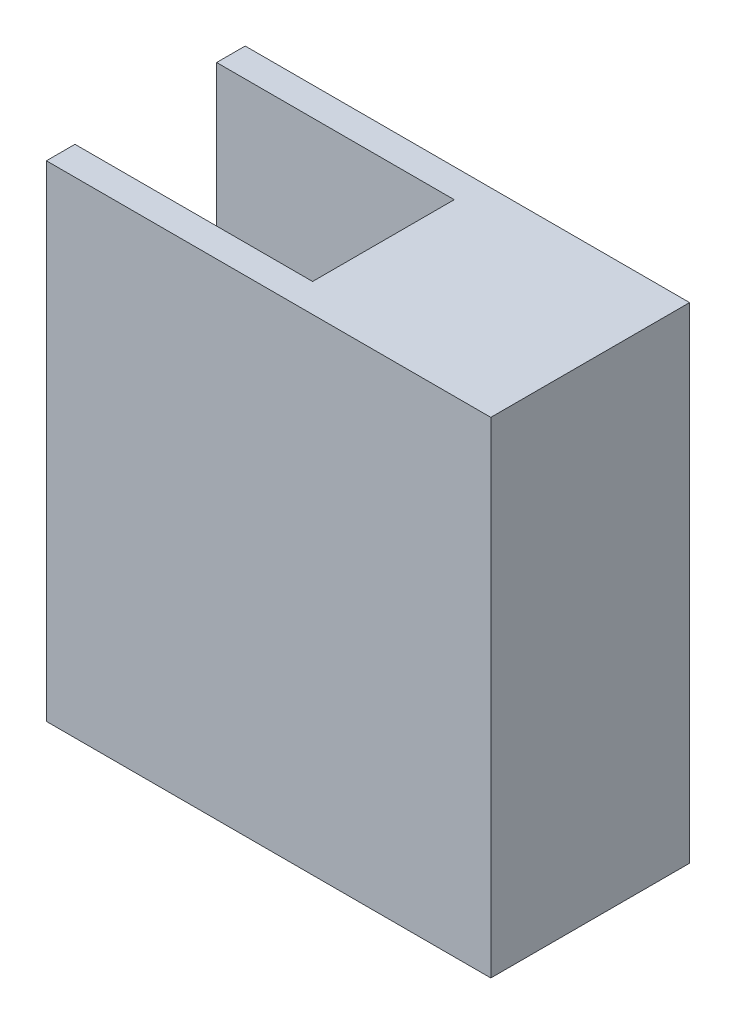
ISO-10303-21;
HEADER;
FILE_DESCRIPTION(('STEP AP214'),'2;1');
FILE_NAME('part.step','',(''),(''),'','','');
FILE_SCHEMA(('AUTOMOTIVE_DESIGN { 1 0 10303 214 1 1 1 1 }'));
ENDSEC;
DATA;
#1=APPLICATION_CONTEXT('core data for automotive mechanical design processes');
#2=APPLICATION_PROTOCOL_DEFINITION('international standard','automotive_design',2000,#1);
#3=PRODUCT_CONTEXT('',#1,'mechanical');
#4=PRODUCT('Part','Part','',(#3));
#5=PRODUCT_RELATED_PRODUCT_CATEGORY('part','',(#4));
#6=PRODUCT_DEFINITION_FORMATION('','',#4);
#7=PRODUCT_DEFINITION_CONTEXT('part definition',#1,'design');
#8=PRODUCT_DEFINITION('design','',#6,#7);
#9=PRODUCT_DEFINITION_SHAPE('','',#8);
#10=(LENGTH_UNIT() NAMED_UNIT(*) SI_UNIT(.MILLI.,.METRE.));
#11=(NAMED_UNIT(*) PLANE_ANGLE_UNIT() SI_UNIT($,.RADIAN.));
#12=(NAMED_UNIT(*) SI_UNIT($,.STERADIAN.) SOLID_ANGLE_UNIT());
#13=UNCERTAINTY_MEASURE_WITH_UNIT(LENGTH_MEASURE(1.E-05),#10,'distance_accuracy_value','');
#14=(GEOMETRIC_REPRESENTATION_CONTEXT(3) GLOBAL_UNCERTAINTY_ASSIGNED_CONTEXT((#13)) GLOBAL_UNIT_ASSIGNED_CONTEXT((#10,
#11,#12)) REPRESENTATION_CONTEXT('',''));
#15=CARTESIAN_POINT('',(0.,0.,0.));
#16=DIRECTION('',(0.,0.,1.));
#17=DIRECTION('',(1.,0.,0.));
#18=AXIS2_PLACEMENT_3D('',#15,#16,#17);
#19=CARTESIAN_POINT('',(-11.557,0.,0.));
#20=DIRECTION('',(1.,0.,0.));
#21=DIRECTION('',(0.,0.,-1.));
#22=AXIS2_PLACEMENT_3D('',#19,#20,#21);
#23=PLANE('',#22);
#24=DIRECTION('',(0.,0.,1.));
#25=VECTOR('',#24,1.);
#26=CARTESIAN_POINT('',(-11.557,13.49375,0.));
#27=LINE('',#26,#25);
#28=CARTESIAN_POINT('',(-11.557,13.49375,3.937));
#29=VERTEX_POINT('',#28);
#30=CARTESIAN_POINT('',(-11.557,13.49375,5.5245));
#31=VERTEX_POINT('',#30);
#32=EDGE_CURVE('E170',#29,#31,#27,.T.);
#33=ORIENTED_EDGE('',*,*,#32,.F.);
#34=DIRECTION('',(0.,1.,0.));
#35=VECTOR('',#34,1.);
#36=CARTESIAN_POINT('',(-11.557,0.,3.937));
#37=LINE('',#36,#35);
#38=CARTESIAN_POINT('',(-11.557,-13.49375,3.937));
#39=VERTEX_POINT('',#38);
#40=EDGE_CURVE('E177',#39,#29,#37,.T.);
#41=ORIENTED_EDGE('',*,*,#40,.F.);
#42=DIRECTION('',(0.,0.,1.));
#43=VECTOR('',#42,1.);
#44=CARTESIAN_POINT('',(-11.557,-13.49375,0.));
#45=LINE('',#44,#43);
#46=CARTESIAN_POINT('',(-11.557,-13.49375,5.5245));
#47=VERTEX_POINT('',#46);
#48=EDGE_CURVE('E167',#39,#47,#45,.T.);
#49=ORIENTED_EDGE('',*,*,#48,.T.);
#50=DIRECTION('',(0.,-1.,0.));
#51=VECTOR('',#50,1.);
#52=CARTESIAN_POINT('',(-11.557,0.,5.5245));
#53=LINE('',#52,#51);
#54=EDGE_CURVE('E174',#31,#47,#53,.T.);
#55=ORIENTED_EDGE('',*,*,#54,.F.);
#56=EDGE_LOOP('',(#33,#41,#49,#55));
#57=FACE_BOUND('',#56,.T.);
#58=ADVANCED_FACE('F33',(#57),#23,.F.);
#59=CARTESIAN_POINT('',(11.557,-11.58875,0.));
#60=DIRECTION('',(0.,-1.,0.));
#61=DIRECTION('',(0.,0.,-1.));
#62=AXIS2_PLACEMENT_3D('',#59,#60,#61);
#63=PLANE('',#62);
#64=DIRECTION('',(0.,0.,1.));
#65=VECTOR('',#64,1.);
#66=CARTESIAN_POINT('',(-11.557,-11.58875,0.));
#67=LINE('',#66,#65);
#68=CARTESIAN_POINT('',(-11.557,-11.58875,-0.508000000000003));
#69=VERTEX_POINT('',#68);
#70=CARTESIAN_POINT('',(-11.557,-11.58875,1.651));
#71=VERTEX_POINT('',#70);
#72=EDGE_CURVE('E156',#69,#71,#67,.T.);
#73=ORIENTED_EDGE('',*,*,#72,.T.);
#74=DIRECTION('',(-1.,0.,0.));
#75=VECTOR('',#74,1.);
#76=CARTESIAN_POINT('',(11.557,-11.58875,1.651));
#77=LINE('',#76,#75);
#78=CARTESIAN_POINT('',(11.557,-11.58875,1.651));
#79=VERTEX_POINT('',#78);
#80=EDGE_CURVE('E11',#79,#71,#77,.T.);
#81=ORIENTED_EDGE('',*,*,#80,.F.);
#82=DIRECTION('',(0.,0.,1.));
#83=VECTOR('',#82,1.);
#84=CARTESIAN_POINT('',(11.557,-11.58875,0.));
#85=LINE('',#84,#83);
#86=CARTESIAN_POINT('',(11.557,-11.58875,-0.508000000000003));
#87=VERTEX_POINT('',#86);
#88=EDGE_CURVE('E184',#87,#79,#85,.T.);
#89=ORIENTED_EDGE('',*,*,#88,.F.);
#90=DIRECTION('',(-1.,0.,0.));
#91=VECTOR('',#90,1.);
#92=CARTESIAN_POINT('',(11.557,-11.58875,-0.508000000000003));
#93=LINE('',#92,#91);
#94=EDGE_CURVE('E155',#87,#69,#93,.T.);
#95=ORIENTED_EDGE('',*,*,#94,.T.);
#96=EDGE_LOOP('',(#73,#81,#89,#95));
#97=FACE_BOUND('',#96,.T.);
#98=ADVANCED_FACE('F35',(#97),#63,.F.);
#99=CARTESIAN_POINT('',(11.557,0.,1.651));
#100=DIRECTION('',(0.,0.,-1.));
#101=DIRECTION('',(0.,1.,0.));
#102=AXIS2_PLACEMENT_3D('',#99,#100,#101);
#103=PLANE('',#102);
#104=DIRECTION('',(0.,-1.,0.));
#105=VECTOR('',#104,1.);
#106=CARTESIAN_POINT('',(-11.557,0.,1.651));
#107=LINE('',#106,#105);
#108=CARTESIAN_POINT('',(-11.557,-13.49375,1.651));
#109=VERTEX_POINT('',#108);
#110=EDGE_CURVE('E159',#71,#109,#107,.T.);
#111=ORIENTED_EDGE('',*,*,#110,.T.);
#112=DIRECTION('',(-1.,0.,0.));
#113=VECTOR('',#112,1.);
#114=CARTESIAN_POINT('',(11.557,-13.49375,1.651));
#115=LINE('',#114,#113);
#116=CARTESIAN_POINT('',(11.557,-13.49375,1.651));
#117=VERTEX_POINT('',#116);
#118=EDGE_CURVE('E41',#117,#109,#115,.T.);
#119=ORIENTED_EDGE('',*,*,#118,.F.);
#120=DIRECTION('',(0.,-1.,0.));
#121=VECTOR('',#120,1.);
#122=CARTESIAN_POINT('',(11.557,0.,1.651));
#123=LINE('',#122,#121);
#124=EDGE_CURVE('E103',#79,#117,#123,.T.);
#125=ORIENTED_EDGE('',*,*,#124,.F.);
#126=ORIENTED_EDGE('',*,*,#80,.T.);
#127=EDGE_LOOP('',(#111,#119,#125,#126));
#128=FACE_BOUND('',#127,.T.);
#129=ADVANCED_FACE('F206',(#128),#103,.F.);
#130=CARTESIAN_POINT('',(11.557,0.,-5.5245));
#131=DIRECTION('',(0.,0.,-1.));
#132=DIRECTION('',(0.,1.,0.));
#133=AXIS2_PLACEMENT_3D('',#130,#131,#132);
#134=PLANE('',#133);
#135=DIRECTION('',(0.,-1.,0.));
#136=VECTOR('',#135,1.);
#137=CARTESIAN_POINT('',(-11.557,0.,-5.5245));
#138=LINE('',#137,#136);
#139=CARTESIAN_POINT('',(-11.557,13.49375,-5.5245));
#140=VERTEX_POINT('',#139);
#141=CARTESIAN_POINT('',(-11.557,-13.49375,-5.5245));
#142=VERTEX_POINT('',#141);
#143=EDGE_CURVE('E166',#140,#142,#138,.T.);
#144=ORIENTED_EDGE('',*,*,#143,.F.);
#145=DIRECTION('',(-1.,0.,0.));
#146=VECTOR('',#145,1.);
#147=CARTESIAN_POINT('',(11.557,13.49375,-5.5245));
#148=LINE('',#147,#146);
#149=CARTESIAN_POINT('',(13.1445,13.49375,-5.5245));
#150=VERTEX_POINT('',#149);
#151=EDGE_CURVE('E196',#150,#140,#148,.T.);
#152=ORIENTED_EDGE('',*,*,#151,.F.);
#153=DIRECTION('',(0.,1.,0.));
#154=VECTOR('',#153,1.);
#155=CARTESIAN_POINT('',(13.1445,13.49375,-5.5245));
#156=LINE('',#155,#154);
#157=CARTESIAN_POINT('',(13.1445,-13.49375,-5.5245));
#158=VERTEX_POINT('',#157);
#159=EDGE_CURVE('E217',#158,#150,#156,.T.);
#160=ORIENTED_EDGE('',*,*,#159,.F.);
#161=DIRECTION('',(-1.,0.,0.));
#162=VECTOR('',#161,1.);
#163=CARTESIAN_POINT('',(11.557,-13.49375,-5.5245));
#164=LINE('',#163,#162);
#165=EDGE_CURVE('E198',#158,#142,#164,.T.);
#166=ORIENTED_EDGE('',*,*,#165,.T.);
#167=EDGE_LOOP('',(#144,#152,#160,#166));
#168=FACE_BOUND('',#167,.T.);
#169=ADVANCED_FACE('F212',(#168),#134,.T.);
#170=CARTESIAN_POINT('',(11.557,13.49375,0.));
#171=DIRECTION('',(0.,-1.,0.));
#172=DIRECTION('',(0.,0.,-1.));
#173=AXIS2_PLACEMENT_3D('',#170,#171,#172);
#174=PLANE('',#173);
#175=DIRECTION('',(0.,0.,-1.));
#176=VECTOR('',#175,1.);
#177=CARTESIAN_POINT('',(1.651,13.49375,3.937));
#178=LINE('',#177,#176);
#179=CARTESIAN_POINT('',(1.651,13.49375,3.937));
#180=VERTEX_POINT('',#179);
#181=CARTESIAN_POINT('',(1.651,13.49375,-3.937));
#182=VERTEX_POINT('',#181);
#183=EDGE_CURVE('E291',#180,#182,#178,.T.);
#184=ORIENTED_EDGE('',*,*,#183,.F.);
#185=DIRECTION('',(1.,0.,0.));
#186=VECTOR('',#185,1.);
#187=CARTESIAN_POINT('',(-11.557,13.49375,3.937));
#188=LINE('',#187,#186);
#189=EDGE_CURVE('E283',#29,#180,#188,.T.);
#190=ORIENTED_EDGE('',*,*,#189,.F.);
#191=ORIENTED_EDGE('',*,*,#32,.T.);
#192=DIRECTION('',(-1.,0.,0.));
#193=VECTOR('',#192,1.);
#194=CARTESIAN_POINT('',(11.557,13.49375,5.5245));
#195=LINE('',#194,#193);
#196=CARTESIAN_POINT('',(13.1445,13.49375,5.5245));
#197=VERTEX_POINT('',#196);
#198=EDGE_CURVE('E193',#197,#31,#195,.T.);
#199=ORIENTED_EDGE('',*,*,#198,.F.);
#200=DIRECTION('',(0.,0.,1.));
#201=VECTOR('',#200,1.);
#202=CARTESIAN_POINT('',(13.1445,13.49375,5.5245));
#203=LINE('',#202,#201);
#204=EDGE_CURVE('E160',#150,#197,#203,.T.);
#205=ORIENTED_EDGE('',*,*,#204,.F.);
#206=ORIENTED_EDGE('',*,*,#151,.T.);
#207=CARTESIAN_POINT('',(-11.557,13.49375,-3.937));
#208=VERTEX_POINT('',#207);
#209=EDGE_CURVE('E171',#140,#208,#27,.T.);
#210=ORIENTED_EDGE('',*,*,#209,.T.);
#211=DIRECTION('',(-1.,0.,0.));
#212=VECTOR('',#211,1.);
#213=CARTESIAN_POINT('',(-11.557,13.49375,-3.937));
#214=LINE('',#213,#212);
#215=EDGE_CURVE('E289',#182,#208,#214,.T.);
#216=ORIENTED_EDGE('',*,*,#215,.F.);
#217=EDGE_LOOP('',(#184,#190,#191,#199,#205,#206,#210,#216));
#218=FACE_BOUND('',#217,.T.);
#219=ADVANCED_FACE('F298',(#218),#174,.F.);
#220=CARTESIAN_POINT('',(11.557,0.,5.5245));
#221=DIRECTION('',(0.,0.,-1.));
#222=DIRECTION('',(0.,1.,0.));
#223=AXIS2_PLACEMENT_3D('',#220,#221,#222);
#224=PLANE('',#223);
#225=ORIENTED_EDGE('',*,*,#54,.T.);
#226=DIRECTION('',(-1.,0.,0.));
#227=VECTOR('',#226,1.);
#228=CARTESIAN_POINT('',(11.557,-13.49375,5.5245));
#229=LINE('',#228,#227);
#230=CARTESIAN_POINT('',(13.1445,-13.49375,5.5245));
#231=VERTEX_POINT('',#230);
#232=EDGE_CURVE('E191',#231,#47,#229,.T.);
#233=ORIENTED_EDGE('',*,*,#232,.F.);
#234=DIRECTION('',(0.,-1.,0.));
#235=VECTOR('',#234,1.);
#236=CARTESIAN_POINT('',(13.1445,13.49375,5.5245));
#237=LINE('',#236,#235);
#238=EDGE_CURVE('E229',#197,#231,#237,.T.);
#239=ORIENTED_EDGE('',*,*,#238,.F.);
#240=ORIENTED_EDGE('',*,*,#198,.T.);
#241=EDGE_LOOP('',(#225,#233,#239,#240));
#242=FACE_BOUND('',#241,.T.);
#243=ADVANCED_FACE('F303',(#242),#224,.F.);
#244=CARTESIAN_POINT('',(11.557,-13.49375,0.));
#245=DIRECTION('',(0.,-1.,0.));
#246=DIRECTION('',(0.,0.,-1.));
#247=AXIS2_PLACEMENT_3D('',#244,#245,#246);
#248=PLANE('',#247);
#249=ORIENTED_EDGE('',*,*,#48,.F.);
#250=DIRECTION('',(-1.,0.,0.));
#251=VECTOR('',#250,1.);
#252=CARTESIAN_POINT('',(11.557,-13.49375,3.937));
#253=LINE('',#252,#251);
#254=CARTESIAN_POINT('',(11.557,-13.49375,3.937));
#255=VERTEX_POINT('',#254);
#256=EDGE_CURVE('E189',#255,#39,#253,.T.);
#257=ORIENTED_EDGE('',*,*,#256,.F.);
#258=DIRECTION('',(0.,0.,-1.));
#259=VECTOR('',#258,1.);
#260=CARTESIAN_POINT('',(11.557,-13.49375,5.5245));
#261=LINE('',#260,#259);
#262=EDGE_CURVE('E205',#255,#117,#261,.T.);
#263=ORIENTED_EDGE('',*,*,#262,.T.);
#264=ORIENTED_EDGE('',*,*,#118,.T.);
#265=EDGE_CURVE('E163',#142,#109,#45,.T.);
#266=ORIENTED_EDGE('',*,*,#265,.F.);
#267=ORIENTED_EDGE('',*,*,#165,.F.);
#268=DIRECTION('',(0.,0.,-1.));
#269=VECTOR('',#268,1.);
#270=CARTESIAN_POINT('',(13.1445,-13.49375,5.5245));
#271=LINE('',#270,#269);
#272=EDGE_CURVE('E221',#231,#158,#271,.T.);
#273=ORIENTED_EDGE('',*,*,#272,.F.);
#274=ORIENTED_EDGE('',*,*,#232,.T.);
#275=EDGE_LOOP('',(#249,#257,#263,#264,#266,#267,#273,#274));
#276=FACE_BOUND('',#275,.T.);
#277=ADVANCED_FACE('F203',(#276),#248,.T.);
#278=CARTESIAN_POINT('',(11.557,0.,3.937));
#279=DIRECTION('',(0.,0.,1.));
#280=DIRECTION('',(1.,0.,0.));
#281=AXIS2_PLACEMENT_3D('',#278,#279,#280);
#282=PLANE('',#281);
#283=ORIENTED_EDGE('',*,*,#40,.T.);
#284=ORIENTED_EDGE('',*,*,#189,.T.);
#285=DIRECTION('',(0.,1.,0.));
#286=VECTOR('',#285,1.);
#287=CARTESIAN_POINT('',(1.651,-13.49475,3.93699999999999));
#288=LINE('',#287,#286);
#289=CARTESIAN_POINT('',(1.651,11.90625,3.937));
#290=VERTEX_POINT('',#289);
#291=EDGE_CURVE('E279',#290,#180,#288,.T.);
#292=ORIENTED_EDGE('',*,*,#291,.F.);
#293=DIRECTION('',(-1.,0.,0.));
#294=VECTOR('',#293,1.);
#295=CARTESIAN_POINT('',(11.557,11.90625,3.937));
#296=LINE('',#295,#294);
#297=CARTESIAN_POINT('',(11.557,11.90625,3.937));
#298=VERTEX_POINT('',#297);
#299=EDGE_CURVE('E131',#298,#290,#296,.T.);
#300=ORIENTED_EDGE('',*,*,#299,.F.);
#301=DIRECTION('',(0.,1.,0.));
#302=VECTOR('',#301,1.);
#303=CARTESIAN_POINT('',(11.557,0.,3.937));
#304=LINE('',#303,#302);
#305=EDGE_CURVE('E146',#255,#298,#304,.T.);
#306=ORIENTED_EDGE('',*,*,#305,.F.);
#307=ORIENTED_EDGE('',*,*,#256,.T.);
#308=EDGE_LOOP('',(#283,#284,#292,#300,#306,#307));
#309=FACE_BOUND('',#308,.T.);
#310=ADVANCED_FACE('F286',(#309),#282,.F.);
#311=CARTESIAN_POINT('',(11.557,11.90625,0.));
#312=DIRECTION('',(0.,1.,0.));
#313=DIRECTION('',(0.,0.,1.));
#314=AXIS2_PLACEMENT_3D('',#311,#312,#313);
#315=PLANE('',#314);
#316=ORIENTED_EDGE('',*,*,#299,.T.);
#317=DIRECTION('',(0.,0.,1.));
#318=VECTOR('',#317,1.);
#319=CARTESIAN_POINT('',(1.651,11.90625,3.93699999999999));
#320=LINE('',#319,#318);
#321=CARTESIAN_POINT('',(1.651,11.90625,-3.937));
#322=VERTEX_POINT('',#321);
#323=EDGE_CURVE('E128',#322,#290,#320,.T.);
#324=ORIENTED_EDGE('',*,*,#323,.F.);
#325=DIRECTION('',(-1.,0.,0.));
#326=VECTOR('',#325,1.);
#327=CARTESIAN_POINT('',(11.557,11.90625,-3.937));
#328=LINE('',#327,#326);
#329=CARTESIAN_POINT('',(11.557,11.90625,-3.937));
#330=VERTEX_POINT('',#329);
#331=EDGE_CURVE('E119',#330,#322,#328,.T.);
#332=ORIENTED_EDGE('',*,*,#331,.F.);
#333=DIRECTION('',(0.,0.,-1.));
#334=VECTOR('',#333,1.);
#335=CARTESIAN_POINT('',(11.557,11.90625,0.));
#336=LINE('',#335,#334);
#337=EDGE_CURVE('E124',#298,#330,#336,.T.);
#338=ORIENTED_EDGE('',*,*,#337,.F.);
#339=EDGE_LOOP('',(#316,#324,#332,#338));
#340=FACE_BOUND('',#339,.T.);
#341=ADVANCED_FACE('F122',(#340),#315,.F.);
#342=CARTESIAN_POINT('',(11.557,0.,-3.937));
#343=DIRECTION('',(0.,0.,-1.));
#344=DIRECTION('',(-1.,0.,0.));
#345=AXIS2_PLACEMENT_3D('',#342,#343,#344);
#346=PLANE('',#345);
#347=DIRECTION('',(0.,-1.,0.));
#348=VECTOR('',#347,1.);
#349=CARTESIAN_POINT('',(-11.557,0.,-3.937));
#350=LINE('',#349,#348);
#351=CARTESIAN_POINT('',(-11.557,3.65124999999999,-3.937));
#352=VERTEX_POINT('',#351);
#353=EDGE_CURVE('E48',#208,#352,#350,.T.);
#354=ORIENTED_EDGE('',*,*,#353,.T.);
#355=DIRECTION('',(-1.,0.,0.));
#356=VECTOR('',#355,1.);
#357=CARTESIAN_POINT('',(11.557,3.65124999999999,-3.937));
#358=LINE('',#357,#356);
#359=CARTESIAN_POINT('',(11.557,3.65124999999999,-3.937));
#360=VERTEX_POINT('',#359);
#361=EDGE_CURVE('E132',#360,#352,#358,.T.);
#362=ORIENTED_EDGE('',*,*,#361,.F.);
#363=DIRECTION('',(0.,-1.,0.));
#364=VECTOR('',#363,1.);
#365=CARTESIAN_POINT('',(11.557,0.,-3.937));
#366=LINE('',#365,#364);
#367=EDGE_CURVE('E135',#330,#360,#366,.T.);
#368=ORIENTED_EDGE('',*,*,#367,.F.);
#369=ORIENTED_EDGE('',*,*,#331,.T.);
#370=DIRECTION('',(0.,1.,0.));
#371=VECTOR('',#370,1.);
#372=CARTESIAN_POINT('',(1.651,-13.49475,-3.93700000000001));
#373=LINE('',#372,#371);
#374=EDGE_CURVE('E237',#322,#182,#373,.T.);
#375=ORIENTED_EDGE('',*,*,#374,.T.);
#376=ORIENTED_EDGE('',*,*,#215,.T.);
#377=EDGE_LOOP('',(#354,#362,#368,#369,#375,#376));
#378=FACE_BOUND('',#377,.T.);
#379=ADVANCED_FACE('F136',(#378),#346,.F.);
#380=CARTESIAN_POINT('',(11.557,3.65124999999999,0.));
#381=DIRECTION('',(0.,-1.,0.));
#382=DIRECTION('',(0.,0.,-1.));
#383=AXIS2_PLACEMENT_3D('',#380,#381,#382);
#384=PLANE('',#383);
#385=DIRECTION('',(0.,0.,1.));
#386=VECTOR('',#385,1.);
#387=CARTESIAN_POINT('',(-11.557,3.65124999999999,0.));
#388=LINE('',#387,#386);
#389=CARTESIAN_POINT('',(-11.557,3.65124999999999,-0.508000000000002));
#390=VERTEX_POINT('',#389);
#391=EDGE_CURVE('E181',#352,#390,#388,.T.);
#392=ORIENTED_EDGE('',*,*,#391,.T.);
#393=DIRECTION('',(-1.,0.,0.));
#394=VECTOR('',#393,1.);
#395=CARTESIAN_POINT('',(11.557,3.65124999999999,-0.508000000000002));
#396=LINE('',#395,#394);
#397=CARTESIAN_POINT('',(11.557,3.65124999999999,-0.508000000000002));
#398=VERTEX_POINT('',#397);
#399=EDGE_CURVE('E57',#398,#390,#396,.T.);
#400=ORIENTED_EDGE('',*,*,#399,.F.);
#401=DIRECTION('',(0.,0.,1.));
#402=VECTOR('',#401,1.);
#403=CARTESIAN_POINT('',(11.557,3.65124999999999,0.));
#404=LINE('',#403,#402);
#405=EDGE_CURVE('E140',#360,#398,#404,.T.);
#406=ORIENTED_EDGE('',*,*,#405,.F.);
#407=ORIENTED_EDGE('',*,*,#361,.T.);
#408=EDGE_LOOP('',(#392,#400,#406,#407));
#409=FACE_BOUND('',#408,.T.);
#410=ADVANCED_FACE('F242',(#409),#384,.F.);
#411=CARTESIAN_POINT('',(11.557,0.,-0.508000000000002));
#412=DIRECTION('',(0.,0.,-1.));
#413=DIRECTION('',(0.,1.,0.));
#414=AXIS2_PLACEMENT_3D('',#411,#412,#413);
#415=PLANE('',#414);
#416=DIRECTION('',(0.,-1.,0.));
#417=VECTOR('',#416,1.);
#418=CARTESIAN_POINT('',(-11.557,0.,-0.508000000000002));
#419=LINE('',#418,#417);
#420=EDGE_CURVE('E95',#390,#69,#419,.T.);
#421=ORIENTED_EDGE('',*,*,#420,.T.);
#422=ORIENTED_EDGE('',*,*,#94,.F.);
#423=DIRECTION('',(0.,-1.,0.));
#424=VECTOR('',#423,1.);
#425=CARTESIAN_POINT('',(11.557,0.,-0.508000000000002));
#426=LINE('',#425,#424);
#427=EDGE_CURVE('E152',#398,#87,#426,.T.);
#428=ORIENTED_EDGE('',*,*,#427,.F.);
#429=ORIENTED_EDGE('',*,*,#399,.T.);
#430=EDGE_LOOP('',(#421,#422,#428,#429));
#431=FACE_BOUND('',#430,.T.);
#432=ADVANCED_FACE('F241',(#431),#415,.F.);
#433=ORIENTED_EDGE('',*,*,#353,.F.);
#434=ORIENTED_EDGE('',*,*,#209,.F.);
#435=ORIENTED_EDGE('',*,*,#143,.T.);
#436=ORIENTED_EDGE('',*,*,#265,.T.);
#437=ORIENTED_EDGE('',*,*,#110,.F.);
#438=ORIENTED_EDGE('',*,*,#72,.F.);
#439=ORIENTED_EDGE('',*,*,#420,.F.);
#440=ORIENTED_EDGE('',*,*,#391,.F.);
#441=EDGE_LOOP('',(#433,#434,#435,#436,#437,#438,#439,#440));
#442=FACE_BOUND('',#441,.T.);
#443=ADVANCED_FACE('F208',(#442),#23,.F.);
#444=CARTESIAN_POINT('',(11.557,0.,0.));
#445=DIRECTION('',(1.,0.,0.));
#446=DIRECTION('',(0.,0.,-1.));
#447=AXIS2_PLACEMENT_3D('',#444,#445,#446);
#448=PLANE('',#447);
#449=ORIENTED_EDGE('',*,*,#88,.T.);
#450=ORIENTED_EDGE('',*,*,#124,.T.);
#451=ORIENTED_EDGE('',*,*,#262,.F.);
#452=ORIENTED_EDGE('',*,*,#305,.T.);
#453=ORIENTED_EDGE('',*,*,#337,.T.);
#454=ORIENTED_EDGE('',*,*,#367,.T.);
#455=ORIENTED_EDGE('',*,*,#405,.T.);
#456=ORIENTED_EDGE('',*,*,#427,.T.);
#457=EDGE_LOOP('',(#449,#450,#451,#452,#453,#454,#455,#456));
#458=FACE_BOUND('',#457,.T.);
#459=ADVANCED_FACE('F143',(#458),#448,.F.);
#460=CARTESIAN_POINT('',(13.1445,0.,0.));
#461=DIRECTION('',(1.,0.,0.));
#462=DIRECTION('',(0.,0.,-1.));
#463=AXIS2_PLACEMENT_3D('',#460,#461,#462);
#464=PLANE('',#463);
#465=ORIENTED_EDGE('',*,*,#238,.T.);
#466=ORIENTED_EDGE('',*,*,#272,.T.);
#467=ORIENTED_EDGE('',*,*,#159,.T.);
#468=ORIENTED_EDGE('',*,*,#204,.T.);
#469=EDGE_LOOP('',(#465,#466,#467,#468));
#470=FACE_BOUND('',#469,.T.);
#471=ADVANCED_FACE('F225',(#470),#464,.T.);
#472=CARTESIAN_POINT('',(1.651,-13.49475,3.93699999999999));
#473=DIRECTION('',(1.,0.,0.));
#474=DIRECTION('',(0.,0.,-1.));
#475=AXIS2_PLACEMENT_3D('',#472,#473,#474);
#476=PLANE('',#475);
#477=ORIENTED_EDGE('',*,*,#323,.T.);
#478=ORIENTED_EDGE('',*,*,#291,.T.);
#479=ORIENTED_EDGE('',*,*,#183,.T.);
#480=ORIENTED_EDGE('',*,*,#374,.F.);
#481=EDGE_LOOP('',(#477,#478,#479,#480));
#482=FACE_BOUND('',#481,.T.);
#483=ADVANCED_FACE('F266',(#482),#476,.F.);
#484=CLOSED_SHELL('',(#58,#98,#129,#169,#219,#243,#277,#310,#341,#379,#410,#432,#443,#459,#471,#483));
#485=MANIFOLD_SOLID_BREP('B2',#484);
#486=ADVANCED_BREP_SHAPE_REPRESENTATION('',(#18,#485),#14);
#487=SHAPE_DEFINITION_REPRESENTATION(#9,#486);
ENDSEC;
END-ISO-10303-21;
